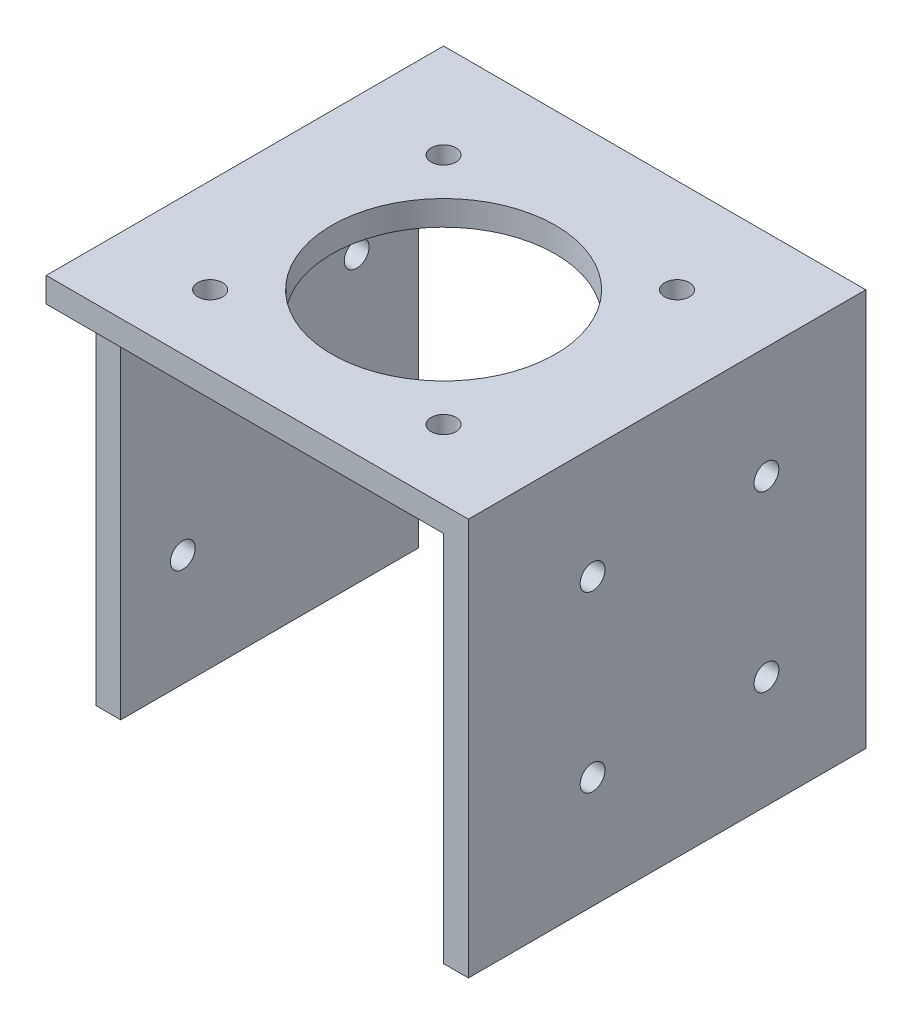
ISO-10303-21;
HEADER;
FILE_DESCRIPTION(('STEP AP214'),'2;1');
FILE_NAME('part.step','',(''),(''),'','','');
FILE_SCHEMA(('AUTOMOTIVE_DESIGN { 1 0 10303 214 1 1 1 1 }'));
ENDSEC;
DATA;
#1=APPLICATION_CONTEXT('core data for automotive mechanical design processes');
#2=APPLICATION_PROTOCOL_DEFINITION('international standard','automotive_design',2000,#1);
#3=PRODUCT_CONTEXT('',#1,'mechanical');
#4=PRODUCT('Part','Part','',(#3));
#5=PRODUCT_RELATED_PRODUCT_CATEGORY('part','',(#4));
#6=PRODUCT_DEFINITION_FORMATION('','',#4);
#7=PRODUCT_DEFINITION_CONTEXT('part definition',#1,'design');
#8=PRODUCT_DEFINITION('design','',#6,#7);
#9=PRODUCT_DEFINITION_SHAPE('','',#8);
#10=(LENGTH_UNIT() NAMED_UNIT(*) SI_UNIT(.MILLI.,.METRE.));
#11=(NAMED_UNIT(*) PLANE_ANGLE_UNIT() SI_UNIT($,.RADIAN.));
#12=(NAMED_UNIT(*) SI_UNIT($,.STERADIAN.) SOLID_ANGLE_UNIT());
#13=UNCERTAINTY_MEASURE_WITH_UNIT(LENGTH_MEASURE(1.E-05),#10,'distance_accuracy_value','');
#14=(GEOMETRIC_REPRESENTATION_CONTEXT(3) GLOBAL_UNCERTAINTY_ASSIGNED_CONTEXT((#13)) GLOBAL_UNIT_ASSIGNED_CONTEXT((#10,
#11,#12)) REPRESENTATION_CONTEXT('',''));
#15=CARTESIAN_POINT('',(0.,0.,0.));
#16=DIRECTION('',(0.,0.,1.));
#17=DIRECTION('',(1.,0.,0.));
#18=AXIS2_PLACEMENT_3D('',#15,#16,#17);
#19=CARTESIAN_POINT('',(-40.,-40.,80.));
#20=DIRECTION('',(0.,1.,0.));
#21=DIRECTION('',(0.,0.,1.));
#22=AXIS2_PLACEMENT_3D('',#19,#20,#21);
#23=PLANE('',#22);
#24=DIRECTION('',(0.,0.,1.));
#25=VECTOR('',#24,1.);
#26=CARTESIAN_POINT('',(-40.,-40.,80.));
#27=LINE('',#26,#25);
#28=CARTESIAN_POINT('',(-40.,-40.,10.));
#29=VERTEX_POINT('',#28);
#30=CARTESIAN_POINT('',(-40.,-40.,70.));
#31=VERTEX_POINT('',#30);
#32=EDGE_CURVE('E224',#29,#31,#27,.T.);
#33=ORIENTED_EDGE('',*,*,#32,.T.);
#34=DIRECTION('',(1.,0.,0.));
#35=VECTOR('',#34,1.);
#36=CARTESIAN_POINT('',(-40.,-40.,70.));
#37=LINE('',#36,#35);
#38=CARTESIAN_POINT('',(-45.,-40.,70.));
#39=VERTEX_POINT('',#38);
#40=EDGE_CURVE('E270',#39,#31,#37,.T.);
#41=ORIENTED_EDGE('',*,*,#40,.F.);
#42=DIRECTION('',(0.,0.,1.));
#43=VECTOR('',#42,1.);
#44=CARTESIAN_POINT('',(-45.,-40.,80.));
#45=LINE('',#44,#43);
#46=CARTESIAN_POINT('',(-45.,-40.,10.));
#47=VERTEX_POINT('',#46);
#48=EDGE_CURVE('E233',#47,#39,#45,.T.);
#49=ORIENTED_EDGE('',*,*,#48,.F.);
#50=DIRECTION('',(-1.,0.,0.));
#51=VECTOR('',#50,1.);
#52=CARTESIAN_POINT('',(-45.,-40.,10.));
#53=LINE('',#52,#51);
#54=EDGE_CURVE('E264',#29,#47,#53,.T.);
#55=ORIENTED_EDGE('',*,*,#54,.F.);
#56=EDGE_LOOP('',(#33,#41,#49,#55));
#57=FACE_BOUND('',#56,.T.);
#58=ADVANCED_FACE('F42',(#57),#23,.F.);
#59=CARTESIAN_POINT('',(40.,40.,80.));
#60=DIRECTION('',(-1.,0.,0.));
#61=DIRECTION('',(0.,0.,1.));
#62=AXIS2_PLACEMENT_3D('',#59,#60,#61);
#63=PLANE('',#62);
#64=CARTESIAN_POINT('',(40.,17.5,55.));
#65=DIRECTION('',(-1.,0.,0.));
#66=DIRECTION('',(0.,0.,1.));
#67=AXIS2_PLACEMENT_3D('',#64,#65,#66);
#68=CIRCLE('',#67,2.49999999999999);
#69=CARTESIAN_POINT('',(40.,17.5,57.5));
#70=VERTEX_POINT('',#69);
#71=EDGE_CURVE('E169',#70,#70,#68,.T.);
#72=ORIENTED_EDGE('',*,*,#71,.T.);
#73=EDGE_LOOP('',(#72));
#74=FACE_BOUND('',#73,.T.);
#75=CARTESIAN_POINT('',(40.,17.5,20.));
#76=DIRECTION('',(-1.,0.,0.));
#77=DIRECTION('',(0.,0.,1.));
#78=AXIS2_PLACEMENT_3D('',#75,#76,#77);
#79=CIRCLE('',#78,2.5);
#80=CARTESIAN_POINT('',(40.,17.5,22.5));
#81=VERTEX_POINT('',#80);
#82=EDGE_CURVE('E172',#81,#81,#79,.T.);
#83=ORIENTED_EDGE('',*,*,#82,.T.);
#84=EDGE_LOOP('',(#83));
#85=FACE_BOUND('',#84,.T.);
#86=CARTESIAN_POINT('',(40.,-17.5,20.));
#87=DIRECTION('',(-1.,0.,0.));
#88=DIRECTION('',(0.,0.,1.));
#89=AXIS2_PLACEMENT_3D('',#86,#87,#88);
#90=CIRCLE('',#89,2.5);
#91=CARTESIAN_POINT('',(40.,-17.5,22.5));
#92=VERTEX_POINT('',#91);
#93=EDGE_CURVE('E175',#92,#92,#90,.T.);
#94=ORIENTED_EDGE('',*,*,#93,.T.);
#95=EDGE_LOOP('',(#94));
#96=FACE_BOUND('',#95,.T.);
#97=CARTESIAN_POINT('',(40.,-17.5,55.));
#98=DIRECTION('',(-1.,0.,0.));
#99=DIRECTION('',(0.,0.,1.));
#100=AXIS2_PLACEMENT_3D('',#97,#98,#99);
#101=CIRCLE('',#100,2.49999999999999);
#102=CARTESIAN_POINT('',(40.,-17.5,57.5));
#103=VERTEX_POINT('',#102);
#104=EDGE_CURVE('E178',#103,#103,#101,.T.);
#105=ORIENTED_EDGE('',*,*,#104,.T.);
#106=EDGE_LOOP('',(#105));
#107=FACE_BOUND('',#106,.T.);
#108=DIRECTION('',(0.,1.,0.));
#109=VECTOR('',#108,1.);
#110=CARTESIAN_POINT('',(40.,40.,0.));
#111=LINE('',#110,#109);
#112=CARTESIAN_POINT('',(40.,-40.,0.));
#113=VERTEX_POINT('',#112);
#114=CARTESIAN_POINT('',(40.,40.,0.));
#115=VERTEX_POINT('',#114);
#116=EDGE_CURVE('E142',#113,#115,#111,.T.);
#117=ORIENTED_EDGE('',*,*,#116,.T.);
#118=DIRECTION('',(0.,0.,-1.));
#119=VECTOR('',#118,1.);
#120=CARTESIAN_POINT('',(40.,40.,80.));
#121=LINE('',#120,#119);
#122=CARTESIAN_POINT('',(40.,40.,80.));
#123=VERTEX_POINT('',#122);
#124=EDGE_CURVE('E11',#123,#115,#121,.T.);
#125=ORIENTED_EDGE('',*,*,#124,.F.);
#126=DIRECTION('',(0.,1.,0.));
#127=VECTOR('',#126,1.);
#128=CARTESIAN_POINT('',(40.,40.,80.));
#129=LINE('',#128,#127);
#130=CARTESIAN_POINT('',(40.,-40.,80.));
#131=VERTEX_POINT('',#130);
#132=EDGE_CURVE('E143',#131,#123,#129,.T.);
#133=ORIENTED_EDGE('',*,*,#132,.F.);
#134=DIRECTION('',(0.,0.,-1.));
#135=VECTOR('',#134,1.);
#136=CARTESIAN_POINT('',(40.,-40.,80.));
#137=LINE('',#136,#135);
#138=EDGE_CURVE('E50',#131,#113,#137,.T.);
#139=ORIENTED_EDGE('',*,*,#138,.T.);
#140=EDGE_LOOP('',(#117,#125,#133,#139));
#141=FACE_BOUND('',#140,.T.);
#142=ADVANCED_FACE('F44',(#74,#85,#96,#107,#141),#63,.F.);
#143=CARTESIAN_POINT('',(-40.,40.,80.));
#144=DIRECTION('',(0.,-1.,0.));
#145=DIRECTION('',(0.,0.,-1.));
#146=AXIS2_PLACEMENT_3D('',#143,#144,#145);
#147=PLANE('',#146);
#148=CARTESIAN_POINT('',(-2.49999999999998,40.,42.5));
#149=DIRECTION('',(0.,-1.,0.));
#150=DIRECTION('',(0.,0.,-1.));
#151=AXIS2_PLACEMENT_3D('',#148,#149,#150);
#152=CIRCLE('',#151,22.5);
#153=CARTESIAN_POINT('',(-2.49999999999998,40.,20.));
#154=VERTEX_POINT('',#153);
#155=EDGE_CURVE('E217',#154,#154,#152,.T.);
#156=ORIENTED_EDGE('',*,*,#155,.T.);
#157=EDGE_LOOP('',(#156));
#158=FACE_BOUND('',#157,.T.);
#159=CARTESIAN_POINT('',(21.,40.,66.));
#160=DIRECTION('',(0.,-1.,0.));
#161=DIRECTION('',(0.,0.,-1.));
#162=AXIS2_PLACEMENT_3D('',#159,#160,#161);
#163=CIRCLE('',#162,2.5);
#164=CARTESIAN_POINT('',(21.,40.,63.5));
#165=VERTEX_POINT('',#164);
#166=EDGE_CURVE('E189',#165,#165,#163,.T.);
#167=ORIENTED_EDGE('',*,*,#166,.T.);
#168=EDGE_LOOP('',(#167));
#169=FACE_BOUND('',#168,.T.);
#170=CARTESIAN_POINT('',(-26.,40.,19.));
#171=DIRECTION('',(0.,-1.,0.));
#172=DIRECTION('',(0.,0.,-1.));
#173=AXIS2_PLACEMENT_3D('',#170,#171,#172);
#174=CIRCLE('',#173,2.49999999999999);
#175=CARTESIAN_POINT('',(-26.,40.,16.5));
#176=VERTEX_POINT('',#175);
#177=EDGE_CURVE('E196',#176,#176,#174,.T.);
#178=ORIENTED_EDGE('',*,*,#177,.T.);
#179=EDGE_LOOP('',(#178));
#180=FACE_BOUND('',#179,.T.);
#181=CARTESIAN_POINT('',(21.,40.,19.));
#182=DIRECTION('',(0.,-1.,0.));
#183=DIRECTION('',(0.,0.,-1.));
#184=AXIS2_PLACEMENT_3D('',#181,#182,#183);
#185=CIRCLE('',#184,2.5);
#186=CARTESIAN_POINT('',(21.,40.,16.5));
#187=VERTEX_POINT('',#186);
#188=EDGE_CURVE('E199',#187,#187,#185,.T.);
#189=ORIENTED_EDGE('',*,*,#188,.T.);
#190=EDGE_LOOP('',(#189));
#191=FACE_BOUND('',#190,.T.);
#192=CARTESIAN_POINT('',(-26.,40.,66.));
#193=DIRECTION('',(0.,-1.,0.));
#194=DIRECTION('',(0.,0.,-1.));
#195=AXIS2_PLACEMENT_3D('',#192,#193,#194);
#196=CIRCLE('',#195,2.5);
#197=CARTESIAN_POINT('',(-26.,40.,63.5));
#198=VERTEX_POINT('',#197);
#199=EDGE_CURVE('E202',#198,#198,#196,.T.);
#200=ORIENTED_EDGE('',*,*,#199,.T.);
#201=EDGE_LOOP('',(#200));
#202=FACE_BOUND('',#201,.T.);
#203=DIRECTION('',(-1.,0.,0.));
#204=VECTOR('',#203,1.);
#205=CARTESIAN_POINT('',(-40.,40.,0.));
#206=LINE('',#205,#204);
#207=CARTESIAN_POINT('',(-45.,40.,0.));
#208=VERTEX_POINT('',#207);
#209=EDGE_CURVE('E144',#115,#208,#206,.T.);
#210=ORIENTED_EDGE('',*,*,#209,.T.);
#211=DIRECTION('',(0.,0.,-1.));
#212=VECTOR('',#211,1.);
#213=CARTESIAN_POINT('',(-45.,40.,0.));
#214=LINE('',#213,#212);
#215=CARTESIAN_POINT('',(-45.,40.,80.));
#216=VERTEX_POINT('',#215);
#217=EDGE_CURVE('E223',#216,#208,#214,.T.);
#218=ORIENTED_EDGE('',*,*,#217,.F.);
#219=DIRECTION('',(-1.,0.,0.));
#220=VECTOR('',#219,1.);
#221=CARTESIAN_POINT('',(-40.,40.,80.));
#222=LINE('',#221,#220);
#223=EDGE_CURVE('E147',#123,#216,#222,.T.);
#224=ORIENTED_EDGE('',*,*,#223,.F.);
#225=ORIENTED_EDGE('',*,*,#124,.T.);
#226=EDGE_LOOP('',(#210,#218,#224,#225));
#227=FACE_BOUND('',#226,.T.);
#228=ADVANCED_FACE('F302',(#158,#169,#180,#191,#202,#227),#147,.F.);
#229=DIRECTION('',(0.,0.,1.));
#230=VECTOR('',#229,1.);
#231=CARTESIAN_POINT('',(35.,-40.,5.));
#232=LINE('',#231,#230);
#233=CARTESIAN_POINT('',(35.,-40.,0.));
#234=VERTEX_POINT('',#233);
#235=CARTESIAN_POINT('',(35.,-40.,80.));
#236=VERTEX_POINT('',#235);
#237=EDGE_CURVE('E118',#234,#236,#232,.T.);
#238=ORIENTED_EDGE('',*,*,#237,.F.);
#239=DIRECTION('',(1.,0.,0.));
#240=VECTOR('',#239,1.);
#241=CARTESIAN_POINT('',(-40.,-40.,0.));
#242=LINE('',#241,#240);
#243=EDGE_CURVE('E123',#234,#113,#242,.T.);
#244=ORIENTED_EDGE('',*,*,#243,.T.);
#245=ORIENTED_EDGE('',*,*,#138,.F.);
#246=DIRECTION('',(1.,0.,0.));
#247=VECTOR('',#246,1.);
#248=CARTESIAN_POINT('',(-40.,-40.,80.));
#249=LINE('',#248,#247);
#250=EDGE_CURVE('E125',#236,#131,#249,.T.);
#251=ORIENTED_EDGE('',*,*,#250,.F.);
#252=EDGE_LOOP('',(#238,#244,#245,#251));
#253=FACE_BOUND('',#252,.T.);
#254=ADVANCED_FACE('F120',(#253),#23,.F.);
#255=CARTESIAN_POINT('',(0.,0.,80.));
#256=DIRECTION('',(0.,0.,1.));
#257=DIRECTION('',(1.,0.,0.));
#258=AXIS2_PLACEMENT_3D('',#255,#256,#257);
#259=PLANE('',#258);
#260=DIRECTION('',(0.,1.,0.));
#261=VECTOR('',#260,1.);
#262=CARTESIAN_POINT('',(-45.,40.,80.));
#263=LINE('',#262,#261);
#264=CARTESIAN_POINT('',(-45.,35.,80.));
#265=VERTEX_POINT('',#264);
#266=EDGE_CURVE('E231',#265,#216,#263,.T.);
#267=ORIENTED_EDGE('',*,*,#266,.F.);
#268=DIRECTION('',(-1.,0.,0.));
#269=VECTOR('',#268,1.);
#270=CARTESIAN_POINT('',(-40.,35.,80.));
#271=LINE('',#270,#269);
#272=CARTESIAN_POINT('',(35.,35.,80.));
#273=VERTEX_POINT('',#272);
#274=EDGE_CURVE('E64',#273,#265,#271,.T.);
#275=ORIENTED_EDGE('',*,*,#274,.F.);
#276=DIRECTION('',(0.,1.,0.));
#277=VECTOR('',#276,1.);
#278=CARTESIAN_POINT('',(35.,35.,80.));
#279=LINE('',#278,#277);
#280=EDGE_CURVE('E167',#236,#273,#279,.T.);
#281=ORIENTED_EDGE('',*,*,#280,.F.);
#282=ORIENTED_EDGE('',*,*,#250,.T.);
#283=ORIENTED_EDGE('',*,*,#132,.T.);
#284=ORIENTED_EDGE('',*,*,#223,.T.);
#285=EDGE_LOOP('',(#267,#275,#281,#282,#283,#284));
#286=FACE_BOUND('',#285,.T.);
#287=ADVANCED_FACE('F303',(#286),#259,.T.);
#288=CARTESIAN_POINT('',(0.,0.,0.));
#289=DIRECTION('',(0.,0.,1.));
#290=DIRECTION('',(1.,0.,0.));
#291=AXIS2_PLACEMENT_3D('',#288,#289,#290);
#292=PLANE('',#291);
#293=DIRECTION('',(0.,-1.,0.));
#294=VECTOR('',#293,1.);
#295=CARTESIAN_POINT('',(35.,-40.,0.));
#296=LINE('',#295,#294);
#297=CARTESIAN_POINT('',(35.,35.,0.));
#298=VERTEX_POINT('',#297);
#299=EDGE_CURVE('E132',#298,#234,#296,.T.);
#300=ORIENTED_EDGE('',*,*,#299,.F.);
#301=DIRECTION('',(1.,0.,0.));
#302=VECTOR('',#301,1.);
#303=CARTESIAN_POINT('',(-40.,35.,0.));
#304=LINE('',#303,#302);
#305=CARTESIAN_POINT('',(-45.,35.,0.));
#306=VERTEX_POINT('',#305);
#307=EDGE_CURVE('E265',#306,#298,#304,.T.);
#308=ORIENTED_EDGE('',*,*,#307,.F.);
#309=DIRECTION('',(0.,-1.,0.));
#310=VECTOR('',#309,1.);
#311=CARTESIAN_POINT('',(-45.,-40.,0.));
#312=LINE('',#311,#310);
#313=EDGE_CURVE('E227',#208,#306,#312,.T.);
#314=ORIENTED_EDGE('',*,*,#313,.F.);
#315=ORIENTED_EDGE('',*,*,#209,.F.);
#316=ORIENTED_EDGE('',*,*,#116,.F.);
#317=ORIENTED_EDGE('',*,*,#243,.F.);
#318=EDGE_LOOP('',(#300,#308,#314,#315,#316,#317));
#319=FACE_BOUND('',#318,.T.);
#320=ADVANCED_FACE('F140',(#319),#292,.F.);
#321=CARTESIAN_POINT('',(-40.,35.,5.));
#322=DIRECTION('',(0.,1.,0.));
#323=DIRECTION('',(0.,0.,1.));
#324=AXIS2_PLACEMENT_3D('',#321,#322,#323);
#325=PLANE('',#324);
#326=CARTESIAN_POINT('',(-2.49999999999998,35.,42.5));
#327=DIRECTION('',(0.,-1.,0.));
#328=DIRECTION('',(0.,0.,-1.));
#329=AXIS2_PLACEMENT_3D('',#326,#327,#328);
#330=CIRCLE('',#329,22.5);
#331=CARTESIAN_POINT('',(-2.49999999999998,35.,20.));
#332=VERTEX_POINT('',#331);
#333=EDGE_CURVE('E220',#332,#332,#330,.T.);
#334=ORIENTED_EDGE('',*,*,#333,.F.);
#335=EDGE_LOOP('',(#334));
#336=FACE_BOUND('',#335,.T.);
#337=CARTESIAN_POINT('',(21.,35.,66.));
#338=DIRECTION('',(0.,-1.,0.));
#339=DIRECTION('',(0.,0.,-1.));
#340=AXIS2_PLACEMENT_3D('',#337,#338,#339);
#341=CIRCLE('',#340,2.5);
#342=CARTESIAN_POINT('',(21.,35.,63.5));
#343=VERTEX_POINT('',#342);
#344=EDGE_CURVE('E208',#343,#343,#341,.T.);
#345=ORIENTED_EDGE('',*,*,#344,.F.);
#346=EDGE_LOOP('',(#345));
#347=FACE_BOUND('',#346,.T.);
#348=CARTESIAN_POINT('',(-26.,35.,19.));
#349=DIRECTION('',(0.,-1.,0.));
#350=DIRECTION('',(0.,0.,-1.));
#351=AXIS2_PLACEMENT_3D('',#348,#349,#350);
#352=CIRCLE('',#351,2.49999999999999);
#353=CARTESIAN_POINT('',(-26.,35.,16.5));
#354=VERTEX_POINT('',#353);
#355=EDGE_CURVE('E209',#354,#354,#352,.T.);
#356=ORIENTED_EDGE('',*,*,#355,.F.);
#357=EDGE_LOOP('',(#356));
#358=FACE_BOUND('',#357,.T.);
#359=CARTESIAN_POINT('',(21.,35.,19.));
#360=DIRECTION('',(0.,-1.,0.));
#361=DIRECTION('',(0.,0.,-1.));
#362=AXIS2_PLACEMENT_3D('',#359,#360,#361);
#363=CIRCLE('',#362,2.5);
#364=CARTESIAN_POINT('',(21.,35.,16.5));
#365=VERTEX_POINT('',#364);
#366=EDGE_CURVE('E212',#365,#365,#363,.T.);
#367=ORIENTED_EDGE('',*,*,#366,.F.);
#368=EDGE_LOOP('',(#367));
#369=FACE_BOUND('',#368,.T.);
#370=CARTESIAN_POINT('',(-26.,35.,66.));
#371=DIRECTION('',(0.,-1.,0.));
#372=DIRECTION('',(0.,0.,-1.));
#373=AXIS2_PLACEMENT_3D('',#370,#371,#372);
#374=CIRCLE('',#373,2.5);
#375=CARTESIAN_POINT('',(-26.,35.,63.5));
#376=VERTEX_POINT('',#375);
#377=EDGE_CURVE('E205',#376,#376,#374,.T.);
#378=ORIENTED_EDGE('',*,*,#377,.F.);
#379=EDGE_LOOP('',(#378));
#380=FACE_BOUND('',#379,.T.);
#381=ORIENTED_EDGE('',*,*,#274,.T.);
#382=DIRECTION('',(0.,0.,-1.));
#383=VECTOR('',#382,1.);
#384=CARTESIAN_POINT('',(-45.,35.,70.));
#385=LINE('',#384,#383);
#386=CARTESIAN_POINT('',(-45.,35.,70.));
#387=VERTEX_POINT('',#386);
#388=EDGE_CURVE('E279',#265,#387,#385,.T.);
#389=ORIENTED_EDGE('',*,*,#388,.T.);
#390=DIRECTION('',(1.,0.,0.));
#391=VECTOR('',#390,1.);
#392=CARTESIAN_POINT('',(-40.,35.,70.));
#393=LINE('',#392,#391);
#394=CARTESIAN_POINT('',(-40.,35.,70.));
#395=VERTEX_POINT('',#394);
#396=EDGE_CURVE('E276',#387,#395,#393,.T.);
#397=ORIENTED_EDGE('',*,*,#396,.T.);
#398=DIRECTION('',(0.,0.,1.));
#399=VECTOR('',#398,1.);
#400=CARTESIAN_POINT('',(-40.,35.,5.));
#401=LINE('',#400,#399);
#402=CARTESIAN_POINT('',(-40.,35.,10.));
#403=VERTEX_POINT('',#402);
#404=EDGE_CURVE('E157',#403,#395,#401,.T.);
#405=ORIENTED_EDGE('',*,*,#404,.F.);
#406=DIRECTION('',(-1.,0.,0.));
#407=VECTOR('',#406,1.);
#408=CARTESIAN_POINT('',(-45.,35.,10.));
#409=LINE('',#408,#407);
#410=CARTESIAN_POINT('',(-45.,35.,10.));
#411=VERTEX_POINT('',#410);
#412=EDGE_CURVE('E57',#403,#411,#409,.T.);
#413=ORIENTED_EDGE('',*,*,#412,.T.);
#414=DIRECTION('',(0.,0.,-1.));
#415=VECTOR('',#414,1.);
#416=CARTESIAN_POINT('',(-45.,35.,0.));
#417=LINE('',#416,#415);
#418=EDGE_CURVE('E262',#411,#306,#417,.T.);
#419=ORIENTED_EDGE('',*,*,#418,.T.);
#420=ORIENTED_EDGE('',*,*,#307,.T.);
#421=DIRECTION('',(0.,0.,1.));
#422=VECTOR('',#421,1.);
#423=CARTESIAN_POINT('',(35.,35.,5.));
#424=LINE('',#423,#422);
#425=EDGE_CURVE('E129',#298,#273,#424,.T.);
#426=ORIENTED_EDGE('',*,*,#425,.T.);
#427=EDGE_LOOP('',(#381,#389,#397,#405,#413,#419,#420,#426));
#428=FACE_BOUND('',#427,.T.);
#429=ADVANCED_FACE('F283',(#336,#347,#358,#369,#380,#428),#325,.F.);
#430=CARTESIAN_POINT('',(35.,35.,5.));
#431=DIRECTION('',(1.,0.,0.));
#432=DIRECTION('',(0.,1.,0.));
#433=AXIS2_PLACEMENT_3D('',#430,#431,#432);
#434=PLANE('',#433);
#435=CARTESIAN_POINT('',(35.,17.5,55.));
#436=DIRECTION('',(-1.,0.,0.));
#437=DIRECTION('',(0.,-1.,0.));
#438=AXIS2_PLACEMENT_3D('',#435,#436,#437);
#439=CIRCLE('',#438,2.49999999999999);
#440=CARTESIAN_POINT('',(35.,15.,55.));
#441=VERTEX_POINT('',#440);
#442=EDGE_CURVE('E185',#441,#441,#439,.T.);
#443=ORIENTED_EDGE('',*,*,#442,.F.);
#444=EDGE_LOOP('',(#443));
#445=FACE_BOUND('',#444,.T.);
#446=CARTESIAN_POINT('',(35.,17.5,20.));
#447=DIRECTION('',(-1.,0.,0.));
#448=DIRECTION('',(0.,-1.,0.));
#449=AXIS2_PLACEMENT_3D('',#446,#447,#448);
#450=CIRCLE('',#449,2.5);
#451=CARTESIAN_POINT('',(35.,15.,20.));
#452=VERTEX_POINT('',#451);
#453=EDGE_CURVE('E188',#452,#452,#450,.T.);
#454=ORIENTED_EDGE('',*,*,#453,.F.);
#455=EDGE_LOOP('',(#454));
#456=FACE_BOUND('',#455,.T.);
#457=CARTESIAN_POINT('',(35.,-17.5,20.));
#458=DIRECTION('',(-1.,0.,0.));
#459=DIRECTION('',(0.,-1.,0.));
#460=AXIS2_PLACEMENT_3D('',#457,#458,#459);
#461=CIRCLE('',#460,2.5);
#462=CARTESIAN_POINT('',(35.,-20.,20.));
#463=VERTEX_POINT('',#462);
#464=EDGE_CURVE('E184',#463,#463,#461,.T.);
#465=ORIENTED_EDGE('',*,*,#464,.F.);
#466=EDGE_LOOP('',(#465));
#467=FACE_BOUND('',#466,.T.);
#468=CARTESIAN_POINT('',(35.,-17.5,55.));
#469=DIRECTION('',(-1.,0.,0.));
#470=DIRECTION('',(0.,-1.,0.));
#471=AXIS2_PLACEMENT_3D('',#468,#469,#470);
#472=CIRCLE('',#471,2.49999999999999);
#473=CARTESIAN_POINT('',(35.,-20.,55.));
#474=VERTEX_POINT('',#473);
#475=EDGE_CURVE('E181',#474,#474,#472,.T.);
#476=ORIENTED_EDGE('',*,*,#475,.F.);
#477=EDGE_LOOP('',(#476));
#478=FACE_BOUND('',#477,.T.);
#479=ORIENTED_EDGE('',*,*,#280,.T.);
#480=ORIENTED_EDGE('',*,*,#425,.F.);
#481=ORIENTED_EDGE('',*,*,#299,.T.);
#482=ORIENTED_EDGE('',*,*,#237,.T.);
#483=EDGE_LOOP('',(#479,#480,#481,#482));
#484=FACE_BOUND('',#483,.T.);
#485=ADVANCED_FACE('F133',(#445,#456,#467,#478,#484),#434,.F.);
#486=CARTESIAN_POINT('',(85.,-17.5,55.));
#487=DIRECTION('',(-1.,0.,0.));
#488=DIRECTION('',(0.,-1.,0.));
#489=AXIS2_PLACEMENT_3D('',#486,#487,#488);
#490=CYLINDRICAL_SURFACE('',#489,2.49999999999999);
#491=ORIENTED_EDGE('',*,*,#475,.T.);
#492=EDGE_LOOP('',(#491));
#493=FACE_BOUND('',#492,.T.);
#494=ORIENTED_EDGE('',*,*,#104,.F.);
#495=EDGE_LOOP('',(#494));
#496=FACE_BOUND('',#495,.T.);
#497=ADVANCED_FACE('F356',(#493,#496),#490,.F.);
#498=CARTESIAN_POINT('',(85.,-17.5,20.));
#499=DIRECTION('',(-1.,0.,0.));
#500=DIRECTION('',(0.,-1.,0.));
#501=AXIS2_PLACEMENT_3D('',#498,#499,#500);
#502=CYLINDRICAL_SURFACE('',#501,2.5);
#503=ORIENTED_EDGE('',*,*,#464,.T.);
#504=EDGE_LOOP('',(#503));
#505=FACE_BOUND('',#504,.T.);
#506=ORIENTED_EDGE('',*,*,#93,.F.);
#507=EDGE_LOOP('',(#506));
#508=FACE_BOUND('',#507,.T.);
#509=ADVANCED_FACE('F353',(#505,#508),#502,.F.);
#510=CARTESIAN_POINT('',(85.,17.5,20.));
#511=DIRECTION('',(-1.,0.,0.));
#512=DIRECTION('',(0.,-1.,0.));
#513=AXIS2_PLACEMENT_3D('',#510,#511,#512);
#514=CYLINDRICAL_SURFACE('',#513,2.5);
#515=ORIENTED_EDGE('',*,*,#453,.T.);
#516=EDGE_LOOP('',(#515));
#517=FACE_BOUND('',#516,.T.);
#518=ORIENTED_EDGE('',*,*,#82,.F.);
#519=EDGE_LOOP('',(#518));
#520=FACE_BOUND('',#519,.T.);
#521=ADVANCED_FACE('F347',(#517,#520),#514,.F.);
#522=CARTESIAN_POINT('',(85.,17.5,55.));
#523=DIRECTION('',(-1.,0.,0.));
#524=DIRECTION('',(0.,-1.,0.));
#525=AXIS2_PLACEMENT_3D('',#522,#523,#524);
#526=CYLINDRICAL_SURFACE('',#525,2.49999999999999);
#527=ORIENTED_EDGE('',*,*,#442,.T.);
#528=EDGE_LOOP('',(#527));
#529=FACE_BOUND('',#528,.T.);
#530=ORIENTED_EDGE('',*,*,#71,.F.);
#531=EDGE_LOOP('',(#530));
#532=FACE_BOUND('',#531,.T.);
#533=ADVANCED_FACE('F337',(#529,#532),#526,.F.);
#534=CARTESIAN_POINT('',(-26.,85.,66.));
#535=DIRECTION('',(0.,-1.,0.));
#536=DIRECTION('',(0.,0.,-1.));
#537=AXIS2_PLACEMENT_3D('',#534,#535,#536);
#538=CYLINDRICAL_SURFACE('',#537,2.5);
#539=ORIENTED_EDGE('',*,*,#377,.T.);
#540=EDGE_LOOP('',(#539));
#541=FACE_BOUND('',#540,.T.);
#542=ORIENTED_EDGE('',*,*,#199,.F.);
#543=EDGE_LOOP('',(#542));
#544=FACE_BOUND('',#543,.T.);
#545=ADVANCED_FACE('F334',(#541,#544),#538,.F.);
#546=CARTESIAN_POINT('',(21.,85.,19.));
#547=DIRECTION('',(0.,-1.,0.));
#548=DIRECTION('',(0.,0.,-1.));
#549=AXIS2_PLACEMENT_3D('',#546,#547,#548);
#550=CYLINDRICAL_SURFACE('',#549,2.5);
#551=ORIENTED_EDGE('',*,*,#366,.T.);
#552=EDGE_LOOP('',(#551));
#553=FACE_BOUND('',#552,.T.);
#554=ORIENTED_EDGE('',*,*,#188,.F.);
#555=EDGE_LOOP('',(#554));
#556=FACE_BOUND('',#555,.T.);
#557=ADVANCED_FACE('F336',(#553,#556),#550,.F.);
#558=CARTESIAN_POINT('',(-26.,85.,19.));
#559=DIRECTION('',(0.,-1.,0.));
#560=DIRECTION('',(0.,0.,-1.));
#561=AXIS2_PLACEMENT_3D('',#558,#559,#560);
#562=CYLINDRICAL_SURFACE('',#561,2.49999999999999);
#563=ORIENTED_EDGE('',*,*,#355,.T.);
#564=EDGE_LOOP('',(#563));
#565=FACE_BOUND('',#564,.T.);
#566=ORIENTED_EDGE('',*,*,#177,.F.);
#567=EDGE_LOOP('',(#566));
#568=FACE_BOUND('',#567,.T.);
#569=ADVANCED_FACE('F344',(#565,#568),#562,.F.);
#570=CARTESIAN_POINT('',(21.,85.,66.));
#571=DIRECTION('',(0.,-1.,0.));
#572=DIRECTION('',(0.,0.,-1.));
#573=AXIS2_PLACEMENT_3D('',#570,#571,#572);
#574=CYLINDRICAL_SURFACE('',#573,2.5);
#575=ORIENTED_EDGE('',*,*,#344,.T.);
#576=EDGE_LOOP('',(#575));
#577=FACE_BOUND('',#576,.T.);
#578=ORIENTED_EDGE('',*,*,#166,.F.);
#579=EDGE_LOOP('',(#578));
#580=FACE_BOUND('',#579,.T.);
#581=ADVANCED_FACE('F456',(#577,#580),#574,.F.);
#582=CARTESIAN_POINT('',(-2.49999999999998,85.,42.5));
#583=DIRECTION('',(0.,-1.,0.));
#584=DIRECTION('',(0.,0.,-1.));
#585=AXIS2_PLACEMENT_3D('',#582,#583,#584);
#586=CYLINDRICAL_SURFACE('',#585,22.5);
#587=ORIENTED_EDGE('',*,*,#333,.T.);
#588=EDGE_LOOP('',(#587));
#589=FACE_BOUND('',#588,.T.);
#590=ORIENTED_EDGE('',*,*,#155,.F.);
#591=EDGE_LOOP('',(#590));
#592=FACE_BOUND('',#591,.T.);
#593=ADVANCED_FACE('F449',(#589,#592),#586,.F.);
#594=CARTESIAN_POINT('',(-40.,0.,0.));
#595=DIRECTION('',(1.,0.,0.));
#596=DIRECTION('',(0.,1.,0.));
#597=AXIS2_PLACEMENT_3D('',#594,#595,#596);
#598=PLANE('',#597);
#599=DIRECTION('',(0.,-1.,0.));
#600=VECTOR('',#599,1.);
#601=CARTESIAN_POINT('',(-40.,35.,70.));
#602=LINE('',#601,#600);
#603=EDGE_CURVE('E259',#395,#31,#602,.T.);
#604=ORIENTED_EDGE('',*,*,#603,.T.);
#605=ORIENTED_EDGE('',*,*,#32,.F.);
#606=DIRECTION('',(0.,-1.,0.));
#607=VECTOR('',#606,1.);
#608=CARTESIAN_POINT('',(-40.,35.,10.));
#609=LINE('',#608,#607);
#610=EDGE_CURVE('E268',#403,#29,#609,.T.);
#611=ORIENTED_EDGE('',*,*,#610,.F.);
#612=ORIENTED_EDGE('',*,*,#404,.T.);
#613=EDGE_LOOP('',(#604,#605,#611,#612));
#614=FACE_BOUND('',#613,.T.);
#615=CARTESIAN_POINT('',(-40.,-17.5,22.5));
#616=DIRECTION('',(-1.,0.,0.));
#617=DIRECTION('',(0.,-1.,0.));
#618=AXIS2_PLACEMENT_3D('',#615,#616,#617);
#619=CIRCLE('',#618,2.5);
#620=CARTESIAN_POINT('',(-40.,-20.,22.5));
#621=VERTEX_POINT('',#620);
#622=EDGE_CURVE('E251',#621,#621,#619,.T.);
#623=ORIENTED_EDGE('',*,*,#622,.T.);
#624=EDGE_LOOP('',(#623));
#625=FACE_BOUND('',#624,.T.);
#626=CARTESIAN_POINT('',(-40.,17.5,57.5));
#627=DIRECTION('',(-1.,0.,0.));
#628=DIRECTION('',(0.,-1.,0.));
#629=AXIS2_PLACEMENT_3D('',#626,#627,#628);
#630=CIRCLE('',#629,2.49999999999999);
#631=CARTESIAN_POINT('',(-40.,15.,57.5));
#632=VERTEX_POINT('',#631);
#633=EDGE_CURVE('E244',#632,#632,#630,.T.);
#634=ORIENTED_EDGE('',*,*,#633,.T.);
#635=EDGE_LOOP('',(#634));
#636=FACE_BOUND('',#635,.T.);
#637=CARTESIAN_POINT('',(-40.,-17.5,57.5));
#638=DIRECTION('',(-1.,0.,0.));
#639=DIRECTION('',(0.,-1.,0.));
#640=AXIS2_PLACEMENT_3D('',#637,#638,#639);
#641=CIRCLE('',#640,2.49999999999999);
#642=CARTESIAN_POINT('',(-40.,-20.,57.5));
#643=VERTEX_POINT('',#642);
#644=EDGE_CURVE('E256',#643,#643,#641,.T.);
#645=ORIENTED_EDGE('',*,*,#644,.T.);
#646=EDGE_LOOP('',(#645));
#647=FACE_BOUND('',#646,.T.);
#648=CARTESIAN_POINT('',(-40.,17.5,22.5));
#649=DIRECTION('',(-1.,0.,0.));
#650=DIRECTION('',(0.,-1.,0.));
#651=AXIS2_PLACEMENT_3D('',#648,#649,#650);
#652=CIRCLE('',#651,2.5);
#653=CARTESIAN_POINT('',(-40.,15.,22.5));
#654=VERTEX_POINT('',#653);
#655=EDGE_CURVE('E228',#654,#654,#652,.T.);
#656=ORIENTED_EDGE('',*,*,#655,.T.);
#657=EDGE_LOOP('',(#656));
#658=FACE_BOUND('',#657,.T.);
#659=ADVANCED_FACE('F294',(#614,#625,#636,#647,#658),#598,.T.);
#660=CARTESIAN_POINT('',(-45.,0.,0.));
#661=DIRECTION('',(1.,0.,0.));
#662=DIRECTION('',(0.,1.,0.));
#663=AXIS2_PLACEMENT_3D('',#660,#661,#662);
#664=PLANE('',#663);
#665=CARTESIAN_POINT('',(-45.,-17.5,22.5));
#666=DIRECTION('',(-1.,0.,0.));
#667=DIRECTION('',(0.,-1.,0.));
#668=AXIS2_PLACEMENT_3D('',#665,#666,#667);
#669=CIRCLE('',#668,2.5);
#670=CARTESIAN_POINT('',(-45.,-20.,22.5));
#671=VERTEX_POINT('',#670);
#672=EDGE_CURVE('E241',#671,#671,#669,.T.);
#673=ORIENTED_EDGE('',*,*,#672,.F.);
#674=EDGE_LOOP('',(#673));
#675=FACE_BOUND('',#674,.T.);
#676=CARTESIAN_POINT('',(-45.,17.5,57.5));
#677=DIRECTION('',(-1.,0.,0.));
#678=DIRECTION('',(0.,-1.,0.));
#679=AXIS2_PLACEMENT_3D('',#676,#677,#678);
#680=CIRCLE('',#679,2.49999999999999);
#681=CARTESIAN_POINT('',(-45.,15.,57.5));
#682=VERTEX_POINT('',#681);
#683=EDGE_CURVE('E247',#682,#682,#680,.T.);
#684=ORIENTED_EDGE('',*,*,#683,.F.);
#685=EDGE_LOOP('',(#684));
#686=FACE_BOUND('',#685,.T.);
#687=CARTESIAN_POINT('',(-45.,-17.5,57.5));
#688=DIRECTION('',(-1.,0.,0.));
#689=DIRECTION('',(0.,-1.,0.));
#690=AXIS2_PLACEMENT_3D('',#687,#688,#689);
#691=CIRCLE('',#690,2.49999999999999);
#692=CARTESIAN_POINT('',(-45.,-20.,57.5));
#693=VERTEX_POINT('',#692);
#694=EDGE_CURVE('E248',#693,#693,#691,.T.);
#695=ORIENTED_EDGE('',*,*,#694,.F.);
#696=EDGE_LOOP('',(#695));
#697=FACE_BOUND('',#696,.T.);
#698=CARTESIAN_POINT('',(-45.,17.5,22.5));
#699=DIRECTION('',(-1.,0.,0.));
#700=DIRECTION('',(0.,-1.,0.));
#701=AXIS2_PLACEMENT_3D('',#698,#699,#700);
#702=CIRCLE('',#701,2.5);
#703=CARTESIAN_POINT('',(-45.,15.,22.5));
#704=VERTEX_POINT('',#703);
#705=EDGE_CURVE('E238',#704,#704,#702,.T.);
#706=ORIENTED_EDGE('',*,*,#705,.F.);
#707=EDGE_LOOP('',(#706));
#708=FACE_BOUND('',#707,.T.);
#709=ORIENTED_EDGE('',*,*,#48,.T.);
#710=DIRECTION('',(0.,-1.,0.));
#711=VECTOR('',#710,1.);
#712=CARTESIAN_POINT('',(-45.,35.,70.));
#713=LINE('',#712,#711);
#714=EDGE_CURVE('E274',#387,#39,#713,.T.);
#715=ORIENTED_EDGE('',*,*,#714,.F.);
#716=ORIENTED_EDGE('',*,*,#388,.F.);
#717=ORIENTED_EDGE('',*,*,#266,.T.);
#718=ORIENTED_EDGE('',*,*,#217,.T.);
#719=ORIENTED_EDGE('',*,*,#313,.T.);
#720=ORIENTED_EDGE('',*,*,#418,.F.);
#721=DIRECTION('',(0.,-1.,0.));
#722=VECTOR('',#721,1.);
#723=CARTESIAN_POINT('',(-45.,35.,10.));
#724=LINE('',#723,#722);
#725=EDGE_CURVE('E137',#411,#47,#724,.T.);
#726=ORIENTED_EDGE('',*,*,#725,.T.);
#727=EDGE_LOOP('',(#709,#715,#716,#717,#718,#719,#720,#726));
#728=FACE_BOUND('',#727,.T.);
#729=ADVANCED_FACE('F286',(#675,#686,#697,#708,#728),#664,.F.);
#730=CARTESIAN_POINT('',(-40.,17.5,22.5));
#731=DIRECTION('',(-1.,0.,0.));
#732=DIRECTION('',(0.,-1.,0.));
#733=AXIS2_PLACEMENT_3D('',#730,#731,#732);
#734=CYLINDRICAL_SURFACE('',#733,2.5);
#735=ORIENTED_EDGE('',*,*,#655,.F.);
#736=EDGE_LOOP('',(#735));
#737=FACE_BOUND('',#736,.T.);
#738=ORIENTED_EDGE('',*,*,#705,.T.);
#739=EDGE_LOOP('',(#738));
#740=FACE_BOUND('',#739,.T.);
#741=ADVANCED_FACE('F428',(#737,#740),#734,.F.);
#742=CARTESIAN_POINT('',(-40.,-17.5,57.5));
#743=DIRECTION('',(-1.,0.,0.));
#744=DIRECTION('',(0.,-1.,0.));
#745=AXIS2_PLACEMENT_3D('',#742,#743,#744);
#746=CYLINDRICAL_SURFACE('',#745,2.49999999999999);
#747=ORIENTED_EDGE('',*,*,#644,.F.);
#748=EDGE_LOOP('',(#747));
#749=FACE_BOUND('',#748,.T.);
#750=ORIENTED_EDGE('',*,*,#694,.T.);
#751=EDGE_LOOP('',(#750));
#752=FACE_BOUND('',#751,.T.);
#753=ADVANCED_FACE('F420',(#749,#752),#746,.F.);
#754=CARTESIAN_POINT('',(-40.,17.5,57.5));
#755=DIRECTION('',(-1.,0.,0.));
#756=DIRECTION('',(0.,-1.,0.));
#757=AXIS2_PLACEMENT_3D('',#754,#755,#756);
#758=CYLINDRICAL_SURFACE('',#757,2.49999999999999);
#759=ORIENTED_EDGE('',*,*,#633,.F.);
#760=EDGE_LOOP('',(#759));
#761=FACE_BOUND('',#760,.T.);
#762=ORIENTED_EDGE('',*,*,#683,.T.);
#763=EDGE_LOOP('',(#762));
#764=FACE_BOUND('',#763,.T.);
#765=ADVANCED_FACE('F412',(#761,#764),#758,.F.);
#766=CARTESIAN_POINT('',(-40.,-17.5,22.5));
#767=DIRECTION('',(-1.,0.,0.));
#768=DIRECTION('',(0.,-1.,0.));
#769=AXIS2_PLACEMENT_3D('',#766,#767,#768);
#770=CYLINDRICAL_SURFACE('',#769,2.5);
#771=ORIENTED_EDGE('',*,*,#622,.F.);
#772=EDGE_LOOP('',(#771));
#773=FACE_BOUND('',#772,.T.);
#774=ORIENTED_EDGE('',*,*,#672,.T.);
#775=EDGE_LOOP('',(#774));
#776=FACE_BOUND('',#775,.T.);
#777=ADVANCED_FACE('F404',(#773,#776),#770,.F.);
#778=CARTESIAN_POINT('',(-45.,35.,10.));
#779=DIRECTION('',(0.,0.,1.));
#780=DIRECTION('',(1.,0.,0.));
#781=AXIS2_PLACEMENT_3D('',#778,#779,#780);
#782=PLANE('',#781);
#783=ORIENTED_EDGE('',*,*,#54,.T.);
#784=ORIENTED_EDGE('',*,*,#725,.F.);
#785=ORIENTED_EDGE('',*,*,#412,.F.);
#786=ORIENTED_EDGE('',*,*,#610,.T.);
#787=EDGE_LOOP('',(#783,#784,#785,#786));
#788=FACE_BOUND('',#787,.T.);
#789=ADVANCED_FACE('F297',(#788),#782,.F.);
#790=CARTESIAN_POINT('',(-40.,35.,70.));
#791=DIRECTION('',(0.,0.,-1.));
#792=DIRECTION('',(-1.,0.,0.));
#793=AXIS2_PLACEMENT_3D('',#790,#791,#792);
#794=PLANE('',#793);
#795=ORIENTED_EDGE('',*,*,#40,.T.);
#796=ORIENTED_EDGE('',*,*,#603,.F.);
#797=ORIENTED_EDGE('',*,*,#396,.F.);
#798=ORIENTED_EDGE('',*,*,#714,.T.);
#799=EDGE_LOOP('',(#795,#796,#797,#798));
#800=FACE_BOUND('',#799,.T.);
#801=ADVANCED_FACE('F290',(#800),#794,.F.);
#802=CLOSED_SHELL('',(#58,#142,#228,#254,#287,#320,#429,#485,#497,#509,#521,#533,#545,#557,#569,
#581,#593,#659,#729,#741,#753,#765,#777,#789,#801));
#803=MANIFOLD_SOLID_BREP('B2',#802);
#804=ADVANCED_BREP_SHAPE_REPRESENTATION('',(#18,#803),#14);
#805=SHAPE_DEFINITION_REPRESENTATION(#9,#804);
ENDSEC;
END-ISO-10303-21;
